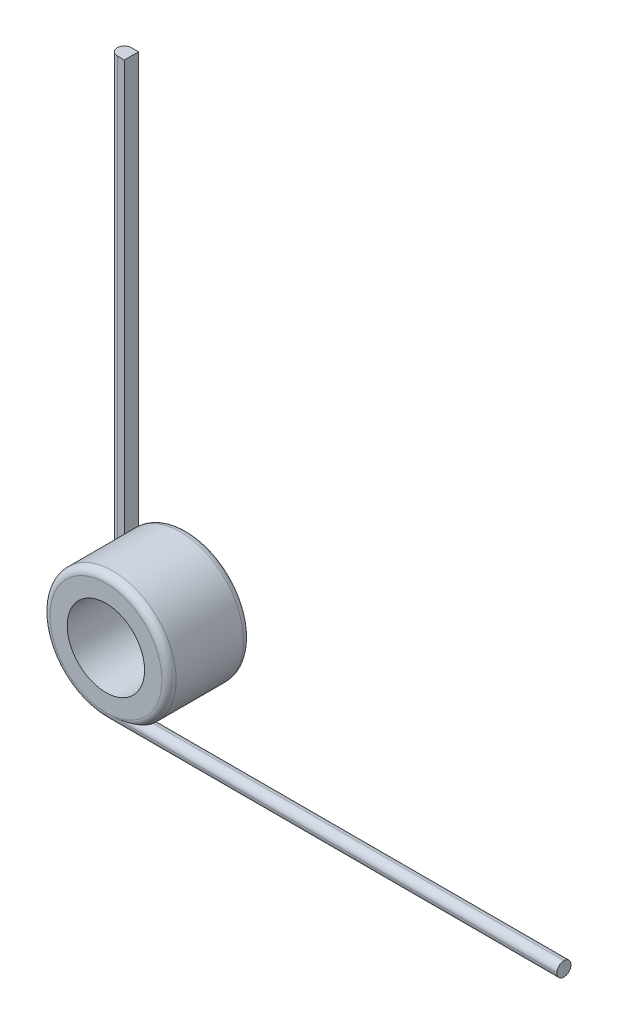
ISO-10303-21;
HEADER;
FILE_DESCRIPTION(('STEP AP214'),'2;1');
FILE_NAME('part.step','',(''),(''),'','','');
FILE_SCHEMA(('AUTOMOTIVE_DESIGN { 1 0 10303 214 1 1 1 1 }'));
ENDSEC;
DATA;
#1=APPLICATION_CONTEXT('core data for automotive mechanical design processes');
#2=APPLICATION_PROTOCOL_DEFINITION('international standard','automotive_design',2000,#1);
#3=PRODUCT_CONTEXT('',#1,'mechanical');
#4=PRODUCT('Part','Part','',(#3));
#5=PRODUCT_RELATED_PRODUCT_CATEGORY('part','',(#4));
#6=PRODUCT_DEFINITION_FORMATION('','',#4);
#7=PRODUCT_DEFINITION_CONTEXT('part definition',#1,'design');
#8=PRODUCT_DEFINITION('design','',#6,#7);
#9=PRODUCT_DEFINITION_SHAPE('','',#8);
#10=(LENGTH_UNIT() NAMED_UNIT(*) SI_UNIT(.MILLI.,.METRE.));
#11=(NAMED_UNIT(*) PLANE_ANGLE_UNIT() SI_UNIT($,.RADIAN.));
#12=(NAMED_UNIT(*) SI_UNIT($,.STERADIAN.) SOLID_ANGLE_UNIT());
#13=UNCERTAINTY_MEASURE_WITH_UNIT(LENGTH_MEASURE(1.E-05),#10,'distance_accuracy_value','');
#14=(GEOMETRIC_REPRESENTATION_CONTEXT(3) GLOBAL_UNCERTAINTY_ASSIGNED_CONTEXT((#13)) GLOBAL_UNIT_ASSIGNED_CONTEXT((#10,
#11,#12)) REPRESENTATION_CONTEXT('',''));
#15=CARTESIAN_POINT('',(0.,0.,0.));
#16=DIRECTION('',(0.,0.,1.));
#17=DIRECTION('',(1.,0.,0.));
#18=AXIS2_PLACEMENT_3D('',#15,#16,#17);
#19=CARTESIAN_POINT('',(0.,0.,9.1948));
#20=DIRECTION('',(0.,0.,1.));
#21=DIRECTION('',(1.,0.,0.));
#22=AXIS2_PLACEMENT_3D('',#19,#20,#21);
#23=PLANE('',#22);
#24=CARTESIAN_POINT('',(0.,0.,9.1948));
#25=DIRECTION('',(0.,0.,1.));
#26=DIRECTION('',(1.,0.,0.));
#27=AXIS2_PLACEMENT_3D('',#24,#25,#26);
#28=CIRCLE('',#27,6.3119);
#29=CARTESIAN_POINT('',(4.11203771063449E-06,-6.31189999999866,9.1948));
#30=VERTEX_POINT('',#29);
#31=EDGE_CURVE('E238',#30,#30,#28,.T.);
#32=ORIENTED_EDGE('',*,*,#31,.T.);
#33=EDGE_LOOP('',(#32));
#34=FACE_BOUND('',#33,.T.);
#35=CARTESIAN_POINT('',(0.,0.,9.1948));
#36=DIRECTION('',(0.,0.,1.));
#37=DIRECTION('',(1.,0.,0.));
#38=AXIS2_PLACEMENT_3D('',#35,#36,#37);
#39=CIRCLE('',#38,4.3561);
#40=CARTESIAN_POINT('',(4.3561,0.,9.1948));
#41=VERTEX_POINT('',#40);
#42=EDGE_CURVE('E146',#41,#41,#39,.T.);
#43=ORIENTED_EDGE('',*,*,#42,.F.);
#44=EDGE_LOOP('',(#43));
#45=FACE_BOUND('',#44,.T.);
#46=ADVANCED_FACE('F35',(#34,#45),#23,.T.);
#47=CARTESIAN_POINT('',(0.,0.,0.));
#48=DIRECTION('',(0.,0.,1.));
#49=DIRECTION('',(1.,0.,0.));
#50=AXIS2_PLACEMENT_3D('',#47,#48,#49);
#51=PLANE('',#50);
#52=DIRECTION('',(0.,1.,0.));
#53=VECTOR('',#52,1.);
#54=CARTESIAN_POINT('',(-5.51179999999999,0.,0.));
#55=LINE('',#54,#53);
#56=CARTESIAN_POINT('',(-5.51179999999997,3.07573444399875,0.));
#57=VERTEX_POINT('',#56);
#58=CARTESIAN_POINT('',(-5.51179999999965,50.8,0.));
#59=VERTEX_POINT('',#58);
#60=EDGE_CURVE('E128',#57,#59,#55,.T.);
#61=ORIENTED_EDGE('',*,*,#60,.F.);
#62=CARTESIAN_POINT('',(0.,0.,0.));
#63=DIRECTION('',(0.,0.,1.));
#64=DIRECTION('',(1.,0.,0.));
#65=AXIS2_PLACEMENT_3D('',#62,#63,#64);
#66=CIRCLE('',#65,6.3119);
#67=CARTESIAN_POINT('',(-6.3119,0.,0.));
#68=VERTEX_POINT('',#67);
#69=EDGE_CURVE('E156',#57,#68,#66,.F.);
#70=ORIENTED_EDGE('',*,*,#69,.T.);
#71=DIRECTION('',(0.,-1.,0.));
#72=VECTOR('',#71,1.);
#73=CARTESIAN_POINT('',(-6.3119,0.,0.));
#74=LINE('',#73,#72);
#75=CARTESIAN_POINT('',(-6.31189999999965,50.8,0.));
#76=VERTEX_POINT('',#75);
#77=EDGE_CURVE('E154',#68,#76,#74,.F.);
#78=ORIENTED_EDGE('',*,*,#77,.T.);
#79=DIRECTION('',(-1.,0.,0.));
#80=VECTOR('',#79,1.);
#81=CARTESIAN_POINT('',(0.,50.8,0.));
#82=LINE('',#81,#80);
#83=EDGE_CURVE('E141',#59,#76,#82,.T.);
#84=ORIENTED_EDGE('',*,*,#83,.F.);
#85=EDGE_LOOP('',(#61,#70,#78,#84));
#86=FACE_BOUND('',#85,.T.);
#87=CARTESIAN_POINT('',(0.,0.,0.));
#88=DIRECTION('',(0.,0.,1.));
#89=DIRECTION('',(1.,0.,0.));
#90=AXIS2_PLACEMENT_3D('',#87,#88,#89);
#91=CIRCLE('',#90,4.3561);
#92=CARTESIAN_POINT('',(4.3561,0.,0.));
#93=VERTEX_POINT('',#92);
#94=EDGE_CURVE('E145',#93,#93,#91,.T.);
#95=ORIENTED_EDGE('',*,*,#94,.T.);
#96=EDGE_LOOP('',(#95));
#97=FACE_BOUND('',#96,.T.);
#98=ADVANCED_FACE('F268',(#86,#97),#51,.F.);
#99=CARTESIAN_POINT('',(0.,0.,9.1948));
#100=DIRECTION('',(0.,0.,-1.));
#101=DIRECTION('',(-1.,0.,0.));
#102=AXIS2_PLACEMENT_3D('',#99,#100,#101);
#103=CYLINDRICAL_SURFACE('',#102,7.112);
#104=CARTESIAN_POINT('',(0.,0.,1.6002));
#105=DIRECTION('',(0.,0.,1.));
#106=DIRECTION('',(1.,0.,0.));
#107=AXIS2_PLACEMENT_3D('',#104,#105,#106);
#108=CIRCLE('',#107,7.112);
#109=CARTESIAN_POINT('',(-5.51179999999996,4.49450828901231,1.6002));
#110=VERTEX_POINT('',#109);
#111=CARTESIAN_POINT('',(-6.31189999999998,3.27726446750949,1.6002));
#112=VERTEX_POINT('',#111);
#113=EDGE_CURVE('E120',#110,#112,#108,.T.);
#114=ORIENTED_EDGE('',*,*,#113,.T.);
#115=CARTESIAN_POINT('',(-6.31189999999998,3.27726446750949,1.6002));
#116=CARTESIAN_POINT('',(-6.33863640810556,3.22577319071098,1.60019125878616));
#117=CARTESIAN_POINT('',(-6.36473209160568,3.17397080121041,1.59886105647557));
#118=CARTESIAN_POINT('',(-6.41559687844701,3.06985554330412,1.59386483641482));
#119=CARTESIAN_POINT('',(-6.44036654805307,3.01754290426369,1.59019982449483));
#120=CARTESIAN_POINT('',(-6.5125478029737,2.86016865994781,1.57618127817764));
#121=CARTESIAN_POINT('',(-6.55794815943721,2.75444607475935,1.5628015122729));
#122=CARTESIAN_POINT('',(-6.64307265846747,2.54227229890445,1.52986497624072));
#123=CARTESIAN_POINT('',(-6.68282029059782,2.43582617169207,1.5103349209512));
#124=CARTESIAN_POINT('',(-6.75692707930679,2.22200236123472,1.46640782392042));
#125=CARTESIAN_POINT('',(-6.79128248733931,2.11462408422718,1.44200742296568));
#126=CARTESIAN_POINT('',(-6.87124565452522,1.84276867346078,1.37562928115081));
#127=CARTESIAN_POINT('',(-6.91331709761538,1.67785384252942,1.33114057764133));
#128=CARTESIAN_POINT('',(-6.98530174523663,1.34713711270923,1.23626000054751));
#129=CARTESIAN_POINT('',(-7.01521160149209,1.18133498224522,1.18586650619416));
#130=CARTESIAN_POINT('',(-7.08709086236258,0.682899888290358,1.02913056514701));
#131=CARTESIAN_POINT('',(-7.11123322508794,0.349157968962985,0.917210823250997));
#132=CARTESIAN_POINT('',(-7.11199400277877,0.0106605278621828,0.803675627695575));
#133=CARTESIAN_POINT('',(-7.1119999947834,0.0053301861345748,0.801887776192952));
#134=CARTESIAN_POINT('',(-7.112,0.,0.8001));
#135=B_SPLINE_CURVE_WITH_KNOTS('',3,(#115,#116,#117,#118,#119,#120,#121,#122,#123,#124,#125,
#126,#127,#128,#129,#130,#131,#132,#133,#134),.UNSPECIFIED.,.F.,.F.,(4,2,2,2,2,2,2,2,2,4),(0.,
0.174006957486824,0.347939003854618,0.695046557647385,1.04066671662638,1.38652608839392,
1.91360707300454,2.44083307318049,3.49502816093425,3.51189470542901),.UNSPECIFIED.);
#136=CARTESIAN_POINT('',(-7.112,0.,0.8001));
#137=VERTEX_POINT('',#136);
#138=EDGE_CURVE('E171',#112,#137,#135,.T.);
#139=ORIENTED_EDGE('',*,*,#138,.T.);
#140=CARTESIAN_POINT('',(0.,0.,0.8001));
#141=DIRECTION('',(0.,0.,1.));
#142=DIRECTION('',(1.,0.,0.));
#143=AXIS2_PLACEMENT_3D('',#140,#141,#142);
#144=CIRCLE('',#143,7.112);
#145=CARTESIAN_POINT('',(-5.51179999999996,4.49450828901231,0.8001));
#146=VERTEX_POINT('',#145);
#147=EDGE_CURVE('E149',#137,#146,#144,.T.);
#148=ORIENTED_EDGE('',*,*,#147,.T.);
#149=DIRECTION('',(0.,0.,-1.));
#150=VECTOR('',#149,1.);
#151=CARTESIAN_POINT('',(-5.51179999999996,4.49450828901231,1.6002));
#152=LINE('',#151,#150);
#153=EDGE_CURVE('E132',#110,#146,#152,.T.);
#154=ORIENTED_EDGE('',*,*,#153,.F.);
#155=EDGE_LOOP('',(#114,#139,#148,#154));
#156=FACE_BOUND('',#155,.T.);
#157=CARTESIAN_POINT('',(0.,0.,8.3947));
#158=DIRECTION('',(0.,0.,1.));
#159=DIRECTION('',(1.,0.,0.));
#160=AXIS2_PLACEMENT_3D('',#157,#158,#159);
#161=CIRCLE('',#160,7.112);
#162=CARTESIAN_POINT('',(0.,-7.112,8.3947));
#163=VERTEX_POINT('',#162);
#164=CARTESIAN_POINT('',(4.49450828901226,-5.51180000000001,8.3947));
#165=VERTEX_POINT('',#164);
#166=EDGE_CURVE('E235',#163,#165,#161,.F.);
#167=ORIENTED_EDGE('',*,*,#166,.T.);
#168=CARTESIAN_POINT('',(4.49450828901226,-5.51180000000001,8.3947));
#169=CARTESIAN_POINT('',(4.49451080113084,-5.51179734371992,8.37810842424166));
#170=CARTESIAN_POINT('',(4.49387482832568,-5.5123165936468,8.36152784188635));
#171=CARTESIAN_POINT('',(4.49135592937111,-5.51436941050985,8.32853975801017));
#172=CARTESIAN_POINT('',(4.48947413973823,-5.51590205296072,8.31213211257161));
#173=CARTESIAN_POINT('',(4.48205587736146,-5.5219345365684,8.26369323033401));
#174=CARTESIAN_POINT('',(4.47474504982169,-5.52787032283946,8.23208982156875));
#175=CARTESIAN_POINT('',(4.45596264204576,-5.5430210661597,8.1711562343011));
#176=CARTESIAN_POINT('',(4.44450479750546,-5.55222519596327,8.14181893480793));
#177=CARTESIAN_POINT('',(4.41809894359944,-5.57326045558614,8.08571438374339));
#178=CARTESIAN_POINT('',(4.40314202243917,-5.58509828934701,8.05895394504016));
#179=CARTESIAN_POINT('',(4.36306513018997,-5.61650291793075,7.99685588317269));
#180=CARTESIAN_POINT('',(4.33639871034843,-5.63715222757647,7.96306879052697));
#181=CARTESIAN_POINT('',(4.27886583268416,-5.6809480055889,7.90124301292569));
#182=CARTESIAN_POINT('',(4.24799289138309,-5.70409831709318,7.87321337246993));
#183=CARTESIAN_POINT('',(4.16495159956195,-5.76520996972485,7.80795333105256));
#184=CARTESIAN_POINT('',(4.11059664917026,-5.8041578265727,7.77445553545377));
#185=CARTESIAN_POINT('',(3.99711041635318,-5.8828975205468,7.7175819204284));
#186=CARTESIAN_POINT('',(3.9379532113367,-5.92269294712346,7.69426605797081));
#187=CARTESIAN_POINT('',(3.82944843548134,-5.99325753988539,7.65997627260489));
#188=CARTESIAN_POINT('',(3.78066363030972,-6.0241600987858,7.64743643431918));
#189=CARTESIAN_POINT('',(3.68163912965761,-6.08518395959253,7.62671601970285));
#190=CARTESIAN_POINT('',(3.63139790534969,-6.11530437261036,7.61854021298335));
#191=CARTESIAN_POINT('',(3.53088358686975,-6.17387384637075,7.60603755194617));
#192=CARTESIAN_POINT('',(3.48063194389849,-6.20234444486788,7.60163576294291));
#193=CARTESIAN_POINT('',(3.37944182452964,-6.25805538206685,7.59592867081584));
#194=CARTESIAN_POINT('',(3.32850544406076,-6.28529869318305,7.59461544250552));
#195=CARTESIAN_POINT('',(3.27726446750944,-6.31190000000001,7.5946));
#196=B_SPLINE_CURVE_WITH_KNOTS('',3,(#168,#169,#170,#171,#172,#173,#174,#175,#176,#177,#178,
#179,#180,#181,#182,#183,#184,#185,#186,#187,#188,#189,#190,#191,#192,#193,#194,#195),
.UNSPECIFIED.,.F.,.F.,(4,2,2,2,2,2,2,2,2,2,2,2,2,4),(0.,0.0497337481254834,0.0994221882394226,
0.197748275093918,0.29575162403428,0.394007348529554,0.536422810542565,0.679060313182284,
0.902181737986765,1.12659987042889,1.30368265533888,1.48095858631475,1.65462723998905,
1.82784977476618),.UNSPECIFIED.);
#197=CARTESIAN_POINT('',(3.27726446750945,-6.3119,7.5946));
#198=VERTEX_POINT('',#197);
#199=EDGE_CURVE('E12',#165,#198,#196,.T.);
#200=ORIENTED_EDGE('',*,*,#199,.T.);
#201=CARTESIAN_POINT('',(3.27726446750945,-6.3119,7.5946));
#202=CARTESIAN_POINT('',(3.22577319071094,-6.33863640810558,7.59460874121384));
#203=CARTESIAN_POINT('',(3.17397080121037,-6.3647320916057,7.59593894352443));
#204=CARTESIAN_POINT('',(3.06985554330409,-6.41559687844702,7.60093516358517));
#205=CARTESIAN_POINT('',(3.01754290426367,-6.44036654805308,7.60460017550516));
#206=CARTESIAN_POINT('',(2.8601686599478,-6.51254780297371,7.61861872182236));
#207=CARTESIAN_POINT('',(2.75444607475934,-6.55794815943721,7.63199848772709));
#208=CARTESIAN_POINT('',(2.54227229890444,-6.64307265846747,7.66493502375927));
#209=CARTESIAN_POINT('',(2.43582617169205,-6.68282029059783,7.6844650790488));
#210=CARTESIAN_POINT('',(2.22200236123469,-6.7569270793068,7.72839217607958));
#211=CARTESIAN_POINT('',(2.11462408422714,-6.79128248733932,7.75279257703432));
#212=CARTESIAN_POINT('',(1.84276867346074,-6.87124565452523,7.81917071884919));
#213=CARTESIAN_POINT('',(1.67785384252937,-6.9133170976154,7.86365942235866));
#214=CARTESIAN_POINT('',(1.34713711270919,-6.98530174523664,7.9585399994525));
#215=CARTESIAN_POINT('',(1.18133498224518,-7.0152116014921,8.0089334938059));
#216=CARTESIAN_POINT('',(0.682899888290264,-7.08709086236258,8.16566943485288));
#217=CARTESIAN_POINT('',(0.349157968962731,-7.11123322508794,8.27758917674841));
#218=CARTESIAN_POINT('',(0.0106605278621274,-7.11199400277877,8.39112437230441));
#219=CARTESIAN_POINT('',(0.00533018613452227,-7.1119999947834,8.39291222380704));
#220=CARTESIAN_POINT('',(0.,-7.112,8.3947));
#221=B_SPLINE_CURVE_WITH_KNOTS('',3,(#201,#202,#203,#204,#205,#206,#207,#208,#209,#210,#211,
#212,#213,#214,#215,#216,#217,#218,#219,#220),.UNSPECIFIED.,.F.,.F.,(4,2,2,2,2,2,2,2,2,4),(0.,
0.174006957486809,0.34793900385459,0.695046557647333,1.04066671662635,1.38652608839392,
1.91360707300454,2.4408330731805,3.49502816093425,3.51189470542901),.UNSPECIFIED.);
#222=EDGE_CURVE('E45',#198,#163,#221,.T.);
#223=ORIENTED_EDGE('',*,*,#222,.T.);
#224=EDGE_LOOP('',(#167,#200,#223));
#225=FACE_BOUND('',#224,.T.);
#226=ADVANCED_FACE('F189',(#156,#225),#103,.T.);
#227=CARTESIAN_POINT('',(0.,0.,9.1948));
#228=DIRECTION('',(0.,0.,-1.));
#229=DIRECTION('',(-1.,0.,0.));
#230=AXIS2_PLACEMENT_3D('',#227,#228,#229);
#231=CYLINDRICAL_SURFACE('',#230,4.3561);
#232=ORIENTED_EDGE('',*,*,#42,.T.);
#233=EDGE_LOOP('',(#232));
#234=FACE_BOUND('',#233,.T.);
#235=ORIENTED_EDGE('',*,*,#94,.F.);
#236=EDGE_LOOP('',(#235));
#237=FACE_BOUND('',#236,.T.);
#238=ADVANCED_FACE('F276',(#234,#237),#231,.F.);
#239=CARTESIAN_POINT('',(-5.51179999999999,0.,1.6002));
#240=DIRECTION('',(-1.,0.,0.));
#241=DIRECTION('',(0.,-1.,0.));
#242=AXIS2_PLACEMENT_3D('',#239,#240,#241);
#243=PLANE('',#242);
#244=ORIENTED_EDGE('',*,*,#60,.T.);
#245=DIRECTION('',(0.,0.,-1.));
#246=VECTOR('',#245,1.);
#247=CARTESIAN_POINT('',(-5.51179999999965,50.8,1.6002));
#248=LINE('',#247,#246);
#249=CARTESIAN_POINT('',(-5.51179999999965,50.8,1.6002));
#250=VERTEX_POINT('',#249);
#251=EDGE_CURVE('E125',#250,#59,#248,.T.);
#252=ORIENTED_EDGE('',*,*,#251,.F.);
#253=DIRECTION('',(0.,1.,0.));
#254=VECTOR('',#253,1.);
#255=CARTESIAN_POINT('',(-5.51179999999999,0.,1.6002));
#256=LINE('',#255,#254);
#257=EDGE_CURVE('E113',#110,#250,#256,.T.);
#258=ORIENTED_EDGE('',*,*,#257,.F.);
#259=ORIENTED_EDGE('',*,*,#153,.T.);
#260=CARTESIAN_POINT('',(-5.51179999999996,4.49450828901231,0.8001));
#261=CARTESIAN_POINT('',(-5.51179999999996,4.49451212575512,0.783443318599203));
#262=CARTESIAN_POINT('',(-5.51179999999996,4.49368446219301,0.766797791956088));
#263=CARTESIAN_POINT('',(-5.51179999999996,4.49040987652128,0.733682291904968));
#264=CARTESIAN_POINT('',(-5.51179999999996,4.48796449376799,0.71721216671612));
#265=CARTESIAN_POINT('',(-5.51179999999996,4.4783348031784,0.66859991189985));
#266=CARTESIAN_POINT('',(-5.51179999999996,4.46885481237349,0.636889945562327));
#267=CARTESIAN_POINT('',(-5.51179999999996,4.44458724650866,0.575760184193653));
#268=CARTESIAN_POINT('',(-5.51179999999997,4.42981804871727,0.546332883518238));
#269=CARTESIAN_POINT('',(-5.51179999999997,4.39591726640818,0.490044895341355));
#270=CARTESIAN_POINT('',(-5.51179999999997,4.37677413911788,0.463191270791761));
#271=CARTESIAN_POINT('',(-5.51179999999997,4.32541769867303,0.400502862079192));
#272=CARTESIAN_POINT('',(-5.51179999999997,4.29125719986009,0.366268491066571));
#273=CARTESIAN_POINT('',(-5.51179999999997,4.21801581487606,0.303622174566199));
#274=CARTESIAN_POINT('',(-5.51179999999997,4.17892704449741,0.275219754744705));
#275=CARTESIAN_POINT('',(-5.51179999999997,4.07421478562361,0.208941025095906));
#276=CARTESIAN_POINT('',(-5.51179999999997,4.00617693020483,0.17490585428096));
#277=CARTESIAN_POINT('',(-5.51179999999997,3.86559668241892,0.117304621239256));
#278=CARTESIAN_POINT('',(-5.51179999999997,3.79303167992426,0.0937968608846556));
#279=CARTESIAN_POINT('',(-5.51179999999997,3.66648386748841,0.0608795160651374));
#280=CARTESIAN_POINT('',(-5.51179999999997,3.61302636778587,0.0493638728781554));
#281=CARTESIAN_POINT('',(-5.51179999999997,3.50538009062013,0.0302235028525491));
#282=CARTESIAN_POINT('',(-5.51179999999997,3.45119073914826,0.0226020370003981));
#283=CARTESIAN_POINT('',(-5.51179999999997,3.34346776715293,0.0108751371750657));
#284=CARTESIAN_POINT('',(-5.51179999999997,3.28994071068312,0.00670691013186622));
#285=CARTESIAN_POINT('',(-5.51179999999997,3.18284684085662,0.0012775985554202));
#286=CARTESIAN_POINT('',(-5.51179999999997,3.12928033840778,1.05223622078087E-05));
#287=CARTESIAN_POINT('',(-5.51179999999997,3.07573444399875,0.));
#288=B_SPLINE_CURVE_WITH_KNOTS('',3,(#260,#261,#262,#263,#264,#265,#266,#267,#268,#269,#270,
#271,#272,#273,#274,#275,#276,#277,#278,#279,#280,#281,#282,#283,#284,#285,#286,#287),
.UNSPECIFIED.,.F.,.F.,(4,2,2,2,2,2,2,2,2,2,2,2,2,4),(0.,0.0499285614137448,0.0998096810294904,
0.198492536802085,0.29683579505006,0.395441641005349,0.539715059762646,0.684222286373899,
0.911182545489275,1.13938464326463,1.3032865973189,1.46732557894686,1.62831183191849,
1.78896530373849),.UNSPECIFIED.);
#289=EDGE_CURVE('E163',#146,#57,#288,.T.);
#290=ORIENTED_EDGE('',*,*,#289,.T.);
#291=EDGE_LOOP('',(#244,#252,#258,#259,#290));
#292=FACE_BOUND('',#291,.T.);
#293=ADVANCED_FACE('F126',(#292),#243,.F.);
#294=CARTESIAN_POINT('',(0.,50.8,1.6002));
#295=DIRECTION('',(0.,-1.,0.));
#296=DIRECTION('',(0.,0.,-1.));
#297=AXIS2_PLACEMENT_3D('',#294,#295,#296);
#298=PLANE('',#297);
#299=CARTESIAN_POINT('',(-6.31189999999965,50.8,0.8001));
#300=DIRECTION('',(0.,-1.,0.));
#301=DIRECTION('',(0.,0.,-1.));
#302=AXIS2_PLACEMENT_3D('',#299,#300,#301);
#303=CIRCLE('',#302,0.8001);
#304=CARTESIAN_POINT('',(-7.11199999999965,50.8,0.8001));
#305=VERTEX_POINT('',#304);
#306=EDGE_CURVE('E160',#76,#305,#303,.F.);
#307=ORIENTED_EDGE('',*,*,#306,.T.);
#308=CARTESIAN_POINT('',(-6.31189999999965,50.8,0.8001));
#309=DIRECTION('',(0.,-1.,0.));
#310=DIRECTION('',(0.,0.,-1.));
#311=AXIS2_PLACEMENT_3D('',#308,#309,#310);
#312=CIRCLE('',#311,0.8001);
#313=CARTESIAN_POINT('',(-6.31189999999965,50.8,1.6002));
#314=VERTEX_POINT('',#313);
#315=EDGE_CURVE('E136',#305,#314,#312,.F.);
#316=ORIENTED_EDGE('',*,*,#315,.T.);
#317=DIRECTION('',(-1.,0.,0.));
#318=VECTOR('',#317,1.);
#319=CARTESIAN_POINT('',(0.,50.8,1.6002));
#320=LINE('',#319,#318);
#321=EDGE_CURVE('E117',#250,#314,#320,.T.);
#322=ORIENTED_EDGE('',*,*,#321,.F.);
#323=ORIENTED_EDGE('',*,*,#251,.T.);
#324=ORIENTED_EDGE('',*,*,#83,.T.);
#325=EDGE_LOOP('',(#307,#316,#322,#323,#324));
#326=FACE_BOUND('',#325,.T.);
#327=ADVANCED_FACE('F134',(#326),#298,.F.);
#328=CARTESIAN_POINT('',(0.,0.,1.6002));
#329=DIRECTION('',(0.,0.,1.));
#330=DIRECTION('',(1.,0.,0.));
#331=AXIS2_PLACEMENT_3D('',#328,#329,#330);
#332=PLANE('',#331);
#333=ORIENTED_EDGE('',*,*,#321,.T.);
#334=DIRECTION('',(0.,-1.,0.));
#335=VECTOR('',#334,1.);
#336=CARTESIAN_POINT('',(-6.3119,0.,1.6002));
#337=LINE('',#336,#335);
#338=EDGE_CURVE('E158',#314,#112,#337,.T.);
#339=ORIENTED_EDGE('',*,*,#338,.T.);
#340=ORIENTED_EDGE('',*,*,#113,.F.);
#341=ORIENTED_EDGE('',*,*,#257,.T.);
#342=EDGE_LOOP('',(#333,#339,#340,#341));
#343=FACE_BOUND('',#342,.T.);
#344=ADVANCED_FACE('F115',(#343),#332,.T.);
#345=CARTESIAN_POINT('',(-6.3119,0.,0.8001));
#346=DIRECTION('',(0.,1.,0.));
#347=DIRECTION('',(-1.,0.,0.));
#348=AXIS2_PLACEMENT_3D('',#345,#346,#347);
#349=CYLINDRICAL_SURFACE('',#348,0.8001);
#350=ORIENTED_EDGE('',*,*,#338,.F.);
#351=ORIENTED_EDGE('',*,*,#315,.F.);
#352=DIRECTION('',(0.,-1.,0.));
#353=VECTOR('',#352,1.);
#354=CARTESIAN_POINT('',(-7.11199999999965,50.8,0.8001));
#355=LINE('',#354,#353);
#356=EDGE_CURVE('E142',#137,#305,#355,.F.);
#357=ORIENTED_EDGE('',*,*,#356,.F.);
#358=ORIENTED_EDGE('',*,*,#138,.F.);
#359=EDGE_LOOP('',(#350,#351,#357,#358));
#360=FACE_BOUND('',#359,.T.);
#361=ADVANCED_FACE('F193',(#360),#349,.T.);
#362=CARTESIAN_POINT('',(-6.3119,0.,0.8001));
#363=DIRECTION('',(0.,-1.,0.));
#364=DIRECTION('',(1.,0.,0.));
#365=AXIS2_PLACEMENT_3D('',#362,#363,#364);
#366=CYLINDRICAL_SURFACE('',#365,0.8001);
#367=ORIENTED_EDGE('',*,*,#306,.F.);
#368=ORIENTED_EDGE('',*,*,#77,.F.);
#369=CARTESIAN_POINT('',(-6.3119,0.,0.8001));
#370=DIRECTION('',(0.,-1.,0.));
#371=DIRECTION('',(1.,0.,0.));
#372=AXIS2_PLACEMENT_3D('',#369,#370,#371);
#373=CIRCLE('',#372,0.8001);
#374=EDGE_CURVE('E230',#137,#68,#373,.T.);
#375=ORIENTED_EDGE('',*,*,#374,.F.);
#376=ORIENTED_EDGE('',*,*,#356,.T.);
#377=EDGE_LOOP('',(#367,#368,#375,#376));
#378=FACE_BOUND('',#377,.T.);
#379=ADVANCED_FACE('F187',(#378),#366,.T.);
#380=CARTESIAN_POINT('',(0.,0.,0.8001));
#381=DIRECTION('',(0.,0.,1.));
#382=DIRECTION('',(1.,0.,0.));
#383=AXIS2_PLACEMENT_3D('',#380,#381,#382);
#384=TOROIDAL_SURFACE('',#383,6.3119,0.8001);
#385=ORIENTED_EDGE('',*,*,#374,.T.);
#386=ORIENTED_EDGE('',*,*,#69,.F.);
#387=ORIENTED_EDGE('',*,*,#289,.F.);
#388=ORIENTED_EDGE('',*,*,#147,.F.);
#389=EDGE_LOOP('',(#385,#386,#387,#388));
#390=FACE_BOUND('',#389,.T.);
#391=ADVANCED_FACE('F182',(#390),#384,.T.);
#392=CARTESIAN_POINT('',(50.8,0.,7.5946));
#393=DIRECTION('',(1.,0.,0.));
#394=DIRECTION('',(0.,0.,-1.));
#395=AXIS2_PLACEMENT_3D('',#392,#393,#394);
#396=PLANE('',#395);
#397=CARTESIAN_POINT('',(50.8,-6.31190000000001,8.3947));
#398=DIRECTION('',(1.,0.,0.));
#399=DIRECTION('',(0.,0.,-1.));
#400=AXIS2_PLACEMENT_3D('',#397,#398,#399);
#401=CIRCLE('',#400,0.8001);
#402=CARTESIAN_POINT('',(50.8,-6.31190000000001,9.1948));
#403=VERTEX_POINT('',#402);
#404=CARTESIAN_POINT('',(50.8,-7.11200000000001,8.3947));
#405=VERTEX_POINT('',#404);
#406=EDGE_CURVE('E231',#403,#405,#401,.T.);
#407=ORIENTED_EDGE('',*,*,#406,.T.);
#408=CARTESIAN_POINT('',(50.8,-6.31190000000001,8.3947));
#409=DIRECTION('',(1.,0.,0.));
#410=DIRECTION('',(0.,0.,-1.));
#411=AXIS2_PLACEMENT_3D('',#408,#409,#410);
#412=CIRCLE('',#411,0.8001);
#413=CARTESIAN_POINT('',(50.8,-6.31190000000001,7.5946));
#414=VERTEX_POINT('',#413);
#415=EDGE_CURVE('E246',#405,#414,#412,.T.);
#416=ORIENTED_EDGE('',*,*,#415,.T.);
#417=CARTESIAN_POINT('',(50.8,-6.31190000000001,8.3947));
#418=DIRECTION('',(1.,0.,0.));
#419=DIRECTION('',(0.,0.,-1.));
#420=AXIS2_PLACEMENT_3D('',#417,#418,#419);
#421=CIRCLE('',#420,0.8001);
#422=CARTESIAN_POINT('',(50.8,-5.51180000000001,8.3947));
#423=VERTEX_POINT('',#422);
#424=EDGE_CURVE('E59',#414,#423,#421,.T.);
#425=ORIENTED_EDGE('',*,*,#424,.T.);
#426=CARTESIAN_POINT('',(50.8,-6.31190000000001,8.3947));
#427=DIRECTION('',(1.,0.,0.));
#428=DIRECTION('',(0.,0.,-1.));
#429=AXIS2_PLACEMENT_3D('',#426,#427,#428);
#430=CIRCLE('',#429,0.8001);
#431=EDGE_CURVE('E233',#423,#403,#430,.T.);
#432=ORIENTED_EDGE('',*,*,#431,.T.);
#433=EDGE_LOOP('',(#407,#416,#425,#432));
#434=FACE_BOUND('',#433,.T.);
#435=ADVANCED_FACE('F186',(#434),#396,.T.);
#436=CARTESIAN_POINT('',(0.,-6.31190000000001,8.3947));
#437=DIRECTION('',(1.,0.,0.));
#438=DIRECTION('',(0.,0.,-1.));
#439=AXIS2_PLACEMENT_3D('',#436,#437,#438);
#440=CYLINDRICAL_SURFACE('',#439,0.8001);
#441=DIRECTION('',(-1.,0.,0.));
#442=VECTOR('',#441,1.);
#443=CARTESIAN_POINT('',(4.49450828901226,-5.51180000000001,8.3947));
#444=LINE('',#443,#442);
#445=EDGE_CURVE('E223',#423,#165,#444,.T.);
#446=ORIENTED_EDGE('',*,*,#445,.F.);
#447=ORIENTED_EDGE('',*,*,#424,.F.);
#448=DIRECTION('',(-1.,0.,0.));
#449=VECTOR('',#448,1.);
#450=CARTESIAN_POINT('',(50.8,-6.31190000000001,7.5946));
#451=LINE('',#450,#449);
#452=EDGE_CURVE('E228',#198,#414,#451,.F.);
#453=ORIENTED_EDGE('',*,*,#452,.F.);
#454=ORIENTED_EDGE('',*,*,#199,.F.);
#455=EDGE_LOOP('',(#446,#447,#453,#454));
#456=FACE_BOUND('',#455,.T.);
#457=ADVANCED_FACE('F37',(#456),#440,.T.);
#458=CARTESIAN_POINT('',(0.,-6.3119,8.3947));
#459=DIRECTION('',(-1.,0.,0.));
#460=DIRECTION('',(0.,-1.,0.));
#461=AXIS2_PLACEMENT_3D('',#458,#459,#460);
#462=CYLINDRICAL_SURFACE('',#461,0.8001);
#463=ORIENTED_EDGE('',*,*,#452,.T.);
#464=ORIENTED_EDGE('',*,*,#415,.F.);
#465=DIRECTION('',(1.,0.,0.));
#466=VECTOR('',#465,1.);
#467=CARTESIAN_POINT('',(50.8,-7.11200000000001,8.3947));
#468=LINE('',#467,#466);
#469=EDGE_CURVE('E216',#163,#405,#468,.T.);
#470=ORIENTED_EDGE('',*,*,#469,.F.);
#471=ORIENTED_EDGE('',*,*,#222,.F.);
#472=EDGE_LOOP('',(#463,#464,#470,#471));
#473=FACE_BOUND('',#472,.T.);
#474=ADVANCED_FACE('F256',(#473),#462,.T.);
#475=CARTESIAN_POINT('',(0.,-6.31190000000001,8.3947));
#476=DIRECTION('',(-1.,0.,0.));
#477=DIRECTION('',(0.,0.,1.));
#478=AXIS2_PLACEMENT_3D('',#475,#476,#477);
#479=CYLINDRICAL_SURFACE('',#478,0.8001);
#480=DIRECTION('',(-1.,0.,0.));
#481=VECTOR('',#480,1.);
#482=CARTESIAN_POINT('',(0.,-6.31190000000001,9.1948));
#483=LINE('',#482,#481);
#484=EDGE_CURVE('E220',#403,#30,#483,.T.);
#485=ORIENTED_EDGE('',*,*,#484,.F.);
#486=ORIENTED_EDGE('',*,*,#431,.F.);
#487=ORIENTED_EDGE('',*,*,#445,.T.);
#488=CARTESIAN_POINT('',(4.49450828901226,-5.51180000000001,8.3947));
#489=CARTESIAN_POINT('',(4.49455617125826,-5.51178205985279,8.4118862482946));
#490=CARTESIAN_POINT('',(4.49295546886804,-5.51235290495125,8.42900224500844));
#491=CARTESIAN_POINT('',(4.4869095043412,-5.5145037205712,8.46243770815079));
#492=CARTESIAN_POINT('',(4.48250162244098,-5.5160704297111,8.47876465272093));
#493=CARTESIAN_POINT('',(4.46994458140216,-5.52052340997563,8.51418490436928));
#494=CARTESIAN_POINT('',(4.46115685700188,-5.52363423130617,8.53301836693115));
#495=CARTESIAN_POINT('',(4.44082746366796,-5.53080224838428,8.56901271185598));
#496=CARTESIAN_POINT('',(4.42927116766586,-5.53486446796762,8.58616400462272));
#497=CARTESIAN_POINT('',(4.39596286024187,-5.54651778565137,8.62951572149106));
#498=CARTESIAN_POINT('',(4.37250778346476,-5.55467127346608,8.65423850049367));
#499=CARTESIAN_POINT('',(4.32251720873424,-5.57188820500328,8.69988342726998));
#500=CARTESIAN_POINT('',(4.29597545840819,-5.58095349046724,8.72079763266959));
#501=CARTESIAN_POINT('',(4.23213756325965,-5.60253859828661,8.76588411968307));
#502=CARTESIAN_POINT('',(4.1941253803704,-5.61523276652446,8.78894522742974));
#503=CARTESIAN_POINT('',(4.11608685300549,-5.64091986641841,8.83122592446432));
#504=CARTESIAN_POINT('',(4.07605675136969,-5.65391332893049,8.85043798968117));
#505=CARTESIAN_POINT('',(3.99451052267212,-5.6799807773322,8.88594819231358));
#506=CARTESIAN_POINT('',(3.95298803989148,-5.69305484428638,8.90223148989094));
#507=CARTESIAN_POINT('',(3.86908091856364,-5.71905052389986,8.9323652216081));
#508=CARTESIAN_POINT('',(3.82669705486045,-5.73197225837322,8.94621774286996));
#509=CARTESIAN_POINT('',(3.72247799910396,-5.7632116981255,8.9776120448812));
#510=CARTESIAN_POINT('',(3.66028774558066,-5.78140265005754,8.99409620111447));
#511=CARTESIAN_POINT('',(3.53495553032642,-5.81712116982577,9.02390006976787));
#512=CARTESIAN_POINT('',(3.47181318338932,-5.83464845850244,9.03721846272209));
#513=CARTESIAN_POINT('',(3.34474600951708,-5.86895557787673,9.06133371691255));
#514=CARTESIAN_POINT('',(3.28082013355969,-5.88573422442642,9.07212669060322));
#515=CARTESIAN_POINT('',(3.15243439301654,-5.91844799410616,9.09163379058246));
#516=CARTESIAN_POINT('',(3.08797445815251,-5.93438300411337,9.10034763862862));
#517=CARTESIAN_POINT('',(2.89400306605375,-5.98083697727947,9.12392647159121));
#518=CARTESIAN_POINT('',(2.76385785466423,-6.01001629671084,9.13623619141539));
#519=CARTESIAN_POINT('',(2.5025498908351,-6.06452257658451,9.15614493519513));
#520=CARTESIAN_POINT('',(2.37138804860274,-6.08985264018478,9.16374776907002));
#521=CARTESIAN_POINT('',(2.08959512801919,-6.13984999712729,9.17656787759887));
#522=CARTESIAN_POINT('',(1.93883566611935,-6.1639161847058,9.18129527771964));
#523=CARTESIAN_POINT('',(1.63669326056512,-6.2067031747915,9.18814890114892));
#524=CARTESIAN_POINT('',(1.48531128369577,-6.2254303652246,9.19027824303884));
#525=CARTESIAN_POINT('',(1.23997463109163,-6.25134927046494,9.19256619409904));
#526=CARTESIAN_POINT('',(1.14619705019648,-6.26021364301892,9.19316704267455));
#527=CARTESIAN_POINT('',(0.958450003112487,-6.27586437252798,9.19402671549977));
#528=CARTESIAN_POINT('',(0.864480506008504,-6.28265036284661,9.1942854794308));
#529=CARTESIAN_POINT('',(0.657661711663856,-6.29527268761071,9.19465722187894));
#530=CARTESIAN_POINT('',(0.544783884473994,-6.30064987848576,9.19473084436427));
#531=CARTESIAN_POINT('',(0.36649350977348,-6.30674924511446,9.19478619060893));
#532=CARTESIAN_POINT('',(0.301113729750644,-6.30847814763423,9.19479356050615));
#533=CARTESIAN_POINT('',(0.194604669897534,-6.3104669829129,9.19479911901859));
#534=CARTESIAN_POINT('',(0.153481064821442,-6.31103396370078,9.19479970005096));
#535=CARTESIAN_POINT('',(0.0749047740188697,-6.31173333170583,9.19479997464711));
#536=CARTESIAN_POINT('',(0.0374523912276173,-6.31190002272857,9.19479974286598));
#537=CARTESIAN_POINT('',(0.,-6.3119,9.1948));
#538=B_SPLINE_CURVE_WITH_KNOTS('',3,(#488,#489,#490,#491,#492,#493,#494,#495,#496,#497,#498,
#499,#500,#501,#502,#503,#504,#505,#506,#507,#508,#509,#510,#511,#512,#513,#514,#515,#516,#517,
#518,#519,#520,#521,#522,#523,#524,#525,#526,#527,#528,#529,#530,#531,#532,#533,#534,#535,#536,
#537),.UNSPECIFIED.,.F.,.F.,(4,2,2,2,2,2,2,2,2,2,2,2,2,2,2,2,2,2,2,2,2,2,2,2,4),(0.,
0.051361895357612,0.102053764829857,0.164743323083665,0.22777168829381,0.332301047223075,
0.437045955201982,0.575434527135161,0.714091035399821,0.853431443136338,0.992651618167765,
1.19311311864189,1.39365802400675,1.59450963980574,1.79538811984529,2.19701236905723,
2.59831110295432,3.05640175011423,3.51394198509666,3.79651299536873,4.07913382383032,
4.41810683130704,4.61430760274629,4.73768820448015,4.85004500222743),.UNSPECIFIED.);
#539=EDGE_CURVE('E209',#30,#165,#538,.F.);
#540=ORIENTED_EDGE('',*,*,#539,.F.);
#541=EDGE_LOOP('',(#485,#486,#487,#540));
#542=FACE_BOUND('',#541,.T.);
#543=ADVANCED_FACE('F205',(#542),#479,.T.);
#544=CARTESIAN_POINT('',(0.,-6.3119,8.3947));
#545=DIRECTION('',(1.,0.,0.));
#546=DIRECTION('',(0.,1.,0.));
#547=AXIS2_PLACEMENT_3D('',#544,#545,#546);
#548=CYLINDRICAL_SURFACE('',#547,0.8001);
#549=ORIENTED_EDGE('',*,*,#406,.F.);
#550=ORIENTED_EDGE('',*,*,#484,.T.);
#551=CARTESIAN_POINT('',(0.,-6.3119,8.3947));
#552=DIRECTION('',(-1.,0.,0.));
#553=DIRECTION('',(0.,-1.,0.));
#554=AXIS2_PLACEMENT_3D('',#551,#552,#553);
#555=CIRCLE('',#554,0.8001);
#556=EDGE_CURVE('E217',#163,#30,#555,.T.);
#557=ORIENTED_EDGE('',*,*,#556,.F.);
#558=ORIENTED_EDGE('',*,*,#469,.T.);
#559=EDGE_LOOP('',(#549,#550,#557,#558));
#560=FACE_BOUND('',#559,.T.);
#561=ADVANCED_FACE('F203',(#560),#548,.T.);
#562=CARTESIAN_POINT('',(0.,0.,8.3947));
#563=DIRECTION('',(0.,0.,1.));
#564=DIRECTION('',(1.,0.,0.));
#565=AXIS2_PLACEMENT_3D('',#562,#563,#564);
#566=TOROIDAL_SURFACE('',#565,6.3119,0.8001);
#567=ORIENTED_EDGE('',*,*,#539,.T.);
#568=ORIENTED_EDGE('',*,*,#166,.F.);
#569=ORIENTED_EDGE('',*,*,#556,.T.);
#570=ORIENTED_EDGE('',*,*,#31,.F.);
#571=EDGE_LOOP('',(#567,#568,#569,#570));
#572=FACE_BOUND('',#571,.T.);
#573=ADVANCED_FACE('F199',(#572),#566,.T.);
#574=CLOSED_SHELL('',(#46,#98,#226,#238,#293,#327,#344,#361,#379,#391,#435,#457,#474,#543,#561,#573));
#575=MANIFOLD_SOLID_BREP('B2',#574);
#576=ADVANCED_BREP_SHAPE_REPRESENTATION('',(#18,#575),#14);
#577=SHAPE_DEFINITION_REPRESENTATION(#9,#576);
ENDSEC;
END-ISO-10303-21;
